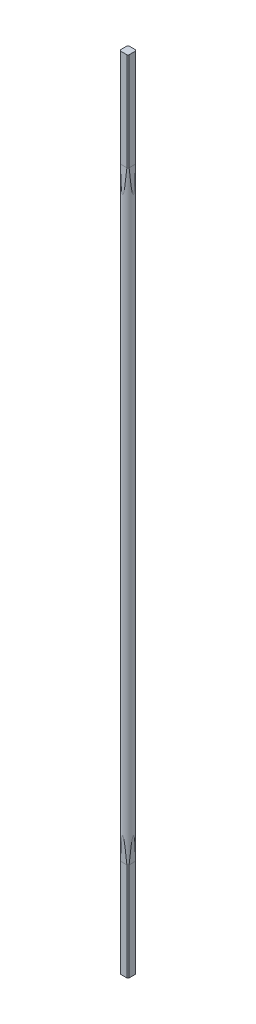
ISO-10303-21;
HEADER;
FILE_DESCRIPTION(('STEP AP214'),'2;1');
FILE_NAME('part.step','',(''),(''),'','','');
FILE_SCHEMA(('AUTOMOTIVE_DESIGN { 1 0 10303 214 1 1 1 1 }'));
ENDSEC;
DATA;
#1=APPLICATION_CONTEXT('core data for automotive mechanical design processes');
#2=APPLICATION_PROTOCOL_DEFINITION('international standard','automotive_design',2000,#1);
#3=PRODUCT_CONTEXT('',#1,'mechanical');
#4=PRODUCT('Part','Part','',(#3));
#5=PRODUCT_RELATED_PRODUCT_CATEGORY('part','',(#4));
#6=PRODUCT_DEFINITION_FORMATION('','',#4);
#7=PRODUCT_DEFINITION_CONTEXT('part definition',#1,'design');
#8=PRODUCT_DEFINITION('design','',#6,#7);
#9=PRODUCT_DEFINITION_SHAPE('','',#8);
#10=(LENGTH_UNIT() NAMED_UNIT(*) SI_UNIT(.MILLI.,.METRE.));
#11=(NAMED_UNIT(*) PLANE_ANGLE_UNIT() SI_UNIT($,.RADIAN.));
#12=(NAMED_UNIT(*) SI_UNIT($,.STERADIAN.) SOLID_ANGLE_UNIT());
#13=UNCERTAINTY_MEASURE_WITH_UNIT(LENGTH_MEASURE(1.E-05),#10,'distance_accuracy_value','');
#14=(GEOMETRIC_REPRESENTATION_CONTEXT(3) GLOBAL_UNCERTAINTY_ASSIGNED_CONTEXT((#13)) GLOBAL_UNIT_ASSIGNED_CONTEXT((#10,
#11,#12)) REPRESENTATION_CONTEXT('',''));
#15=CARTESIAN_POINT('',(0.,0.,0.));
#16=DIRECTION('',(0.,0.,1.));
#17=DIRECTION('',(1.,0.,0.));
#18=AXIS2_PLACEMENT_3D('',#15,#16,#17);
#19=CARTESIAN_POINT('',(0.,-245.,0.));
#20=DIRECTION('',(0.,1.,0.));
#21=DIRECTION('',(0.,0.,1.));
#22=AXIS2_PLACEMENT_3D('',#19,#20,#21);
#23=CYLINDRICAL_SURFACE('',#22,3.3);
#24=DIRECTION('',(0.,1.,0.));
#25=VECTOR('',#24,1.);
#26=CARTESIAN_POINT('',(1.96659604392971,-245.,2.65));
#27=LINE('',#26,#25);
#28=CARTESIAN_POINT('',(1.96659604392971,245.,2.65));
#29=VERTEX_POINT('',#28);
#30=CARTESIAN_POINT('',(1.96659604392971,185.,2.65));
#31=VERTEX_POINT('',#30);
#32=EDGE_CURVE('E305',#29,#31,#27,.F.);
#33=ORIENTED_EDGE('',*,*,#32,.T.);
#34=CARTESIAN_POINT('',(0.,245.694978703343,0.));
#35=DIRECTION('',(0.,-0.0436193873653361,-0.999048221581858));
#36=DIRECTION('',(0.,0.999048221581858,-0.0436193873653361));
#37=AXIS2_PLACEMENT_3D('',#34,#35,#36);
#38=ELLIPSE('',#37,75.6544325659759,3.3);
#39=CARTESIAN_POINT('',(-1.96659604392971,185.,2.65));
#40=VERTEX_POINT('',#39);
#41=EDGE_CURVE('E287',#31,#40,#38,.T.);
#42=ORIENTED_EDGE('',*,*,#41,.T.);
#43=DIRECTION('',(0.,1.,0.));
#44=VECTOR('',#43,1.);
#45=CARTESIAN_POINT('',(-1.96659604392971,-245.,2.65));
#46=LINE('',#45,#44);
#47=CARTESIAN_POINT('',(-1.96659604392971,245.,2.65));
#48=VERTEX_POINT('',#47);
#49=EDGE_CURVE('E302',#40,#48,#46,.T.);
#50=ORIENTED_EDGE('',*,*,#49,.T.);
#51=CARTESIAN_POINT('',(0.,245.,0.));
#52=DIRECTION('',(0.,1.,0.));
#53=DIRECTION('',(0.,0.,1.));
#54=AXIS2_PLACEMENT_3D('',#51,#52,#53);
#55=CIRCLE('',#54,3.3);
#56=CARTESIAN_POINT('',(-2.65,245.,1.96659604392971));
#57=VERTEX_POINT('',#56);
#58=EDGE_CURVE('E326',#57,#48,#55,.T.);
#59=ORIENTED_EDGE('',*,*,#58,.F.);
#60=DIRECTION('',(0.,1.,0.));
#61=VECTOR('',#60,1.);
#62=CARTESIAN_POINT('',(-2.65,-245.,1.96659604392971));
#63=LINE('',#62,#61);
#64=CARTESIAN_POINT('',(-2.65,185.,1.96659604392971));
#65=VERTEX_POINT('',#64);
#66=EDGE_CURVE('E323',#57,#65,#63,.F.);
#67=ORIENTED_EDGE('',*,*,#66,.T.);
#68=CARTESIAN_POINT('',(0.,245.694978703343,0.));
#69=DIRECTION('',(0.999048221581858,-0.0436193873653361,0.));
#70=DIRECTION('',(0.0436193873653361,0.999048221581858,0.));
#71=AXIS2_PLACEMENT_3D('',#68,#69,#70);
#72=ELLIPSE('',#71,75.6544325659759,3.3);
#73=CARTESIAN_POINT('',(-2.64999999999999,185.,-1.96659604392971));
#74=VERTEX_POINT('',#73);
#75=EDGE_CURVE('E273',#65,#74,#72,.T.);
#76=ORIENTED_EDGE('',*,*,#75,.T.);
#77=DIRECTION('',(0.,1.,0.));
#78=VECTOR('',#77,1.);
#79=CARTESIAN_POINT('',(-2.65,-245.,-1.96659604392971));
#80=LINE('',#79,#78);
#81=CARTESIAN_POINT('',(-2.65,245.,-1.96659604392971));
#82=VERTEX_POINT('',#81);
#83=EDGE_CURVE('E320',#74,#82,#80,.T.);
#84=ORIENTED_EDGE('',*,*,#83,.T.);
#85=CARTESIAN_POINT('',(-1.96659604392971,245.,-2.65));
#86=VERTEX_POINT('',#85);
#87=EDGE_CURVE('E422',#86,#82,#55,.T.);
#88=ORIENTED_EDGE('',*,*,#87,.F.);
#89=DIRECTION('',(0.,1.,0.));
#90=VECTOR('',#89,1.);
#91=CARTESIAN_POINT('',(-1.96659604392971,-245.,-2.65));
#92=LINE('',#91,#90);
#93=CARTESIAN_POINT('',(-1.96659604392971,185.,-2.65));
#94=VERTEX_POINT('',#93);
#95=EDGE_CURVE('E317',#86,#94,#92,.F.);
#96=ORIENTED_EDGE('',*,*,#95,.T.);
#97=CARTESIAN_POINT('',(0.,245.694978703343,0.));
#98=DIRECTION('',(0.,-0.0436193873653361,0.999048221581858));
#99=DIRECTION('',(0.,0.999048221581858,0.0436193873653361));
#100=AXIS2_PLACEMENT_3D('',#97,#98,#99);
#101=ELLIPSE('',#100,75.6544325659759,3.3);
#102=CARTESIAN_POINT('',(1.96659604392971,185.,-2.64999999999999));
#103=VERTEX_POINT('',#102);
#104=EDGE_CURVE('E276',#94,#103,#101,.T.);
#105=ORIENTED_EDGE('',*,*,#104,.T.);
#106=DIRECTION('',(0.,1.,0.));
#107=VECTOR('',#106,1.);
#108=CARTESIAN_POINT('',(1.96659604392971,-245.,-2.65));
#109=LINE('',#108,#107);
#110=CARTESIAN_POINT('',(1.96659604392971,245.,-2.65));
#111=VERTEX_POINT('',#110);
#112=EDGE_CURVE('E314',#103,#111,#109,.T.);
#113=ORIENTED_EDGE('',*,*,#112,.T.);
#114=CARTESIAN_POINT('',(2.65,245.,-1.96659604392971));
#115=VERTEX_POINT('',#114);
#116=EDGE_CURVE('E331',#115,#111,#55,.T.);
#117=ORIENTED_EDGE('',*,*,#116,.F.);
#118=DIRECTION('',(0.,1.,0.));
#119=VECTOR('',#118,1.);
#120=CARTESIAN_POINT('',(2.65,-245.,-1.96659604392971));
#121=LINE('',#120,#119);
#122=CARTESIAN_POINT('',(2.65,185.,-1.96659604392971));
#123=VERTEX_POINT('',#122);
#124=EDGE_CURVE('E311',#115,#123,#121,.F.);
#125=ORIENTED_EDGE('',*,*,#124,.T.);
#126=CARTESIAN_POINT('',(0.,245.694978703343,0.));
#127=DIRECTION('',(-0.999048221581858,-0.0436193873653361,0.));
#128=DIRECTION('',(-0.0436193873653361,0.999048221581858,0.));
#129=AXIS2_PLACEMENT_3D('',#126,#127,#128);
#130=ELLIPSE('',#129,75.6544325659759,3.3);
#131=CARTESIAN_POINT('',(2.65,185.,1.96659604392971));
#132=VERTEX_POINT('',#131);
#133=EDGE_CURVE('E284',#123,#132,#130,.T.);
#134=ORIENTED_EDGE('',*,*,#133,.T.);
#135=DIRECTION('',(0.,1.,0.));
#136=VECTOR('',#135,1.);
#137=CARTESIAN_POINT('',(2.65,-245.,1.96659604392971));
#138=LINE('',#137,#136);
#139=CARTESIAN_POINT('',(2.65,245.,1.96659604392971));
#140=VERTEX_POINT('',#139);
#141=EDGE_CURVE('E308',#132,#140,#138,.T.);
#142=ORIENTED_EDGE('',*,*,#141,.T.);
#143=EDGE_CURVE('E327',#29,#140,#55,.T.);
#144=ORIENTED_EDGE('',*,*,#143,.F.);
#145=EDGE_LOOP('',(#33,#42,#50,#59,#67,#76,#84,#88,#96,#105,#113,#117,#125,#134,#142,#144));
#146=FACE_BOUND('',#145,.T.);
#147=DIRECTION('',(0.,1.,0.));
#148=VECTOR('',#147,1.);
#149=CARTESIAN_POINT('',(1.96659604392971,-245.,-2.65));
#150=LINE('',#149,#148);
#151=CARTESIAN_POINT('',(1.96659604392971,-245.,-2.65));
#152=VERTEX_POINT('',#151);
#153=CARTESIAN_POINT('',(1.96659604392971,-185.,-2.65));
#154=VERTEX_POINT('',#153);
#155=EDGE_CURVE('E379',#152,#154,#150,.T.);
#156=ORIENTED_EDGE('',*,*,#155,.T.);
#157=CARTESIAN_POINT('',(0.,-245.694978703343,0.));
#158=DIRECTION('',(0.,0.0436193873653361,0.999048221581858));
#159=DIRECTION('',(0.,0.999048221581858,-0.0436193873653361));
#160=AXIS2_PLACEMENT_3D('',#157,#158,#159);
#161=ELLIPSE('',#160,75.6544325659759,3.3);
#162=CARTESIAN_POINT('',(-1.96659604392971,-185.,-2.65));
#163=VERTEX_POINT('',#162);
#164=EDGE_CURVE('E261',#154,#163,#161,.T.);
#165=ORIENTED_EDGE('',*,*,#164,.T.);
#166=DIRECTION('',(0.,1.,0.));
#167=VECTOR('',#166,1.);
#168=CARTESIAN_POINT('',(-1.96659604392971,-245.,-2.65));
#169=LINE('',#168,#167);
#170=CARTESIAN_POINT('',(-1.96659604392971,-245.,-2.65));
#171=VERTEX_POINT('',#170);
#172=EDGE_CURVE('E374',#163,#171,#169,.F.);
#173=ORIENTED_EDGE('',*,*,#172,.T.);
#174=CARTESIAN_POINT('',(0.,-245.,0.));
#175=DIRECTION('',(0.,1.,0.));
#176=DIRECTION('',(0.,0.,1.));
#177=AXIS2_PLACEMENT_3D('',#174,#175,#176);
#178=CIRCLE('',#177,3.3);
#179=CARTESIAN_POINT('',(-2.65,-245.,-1.96659604392971));
#180=VERTEX_POINT('',#179);
#181=EDGE_CURVE('E395',#171,#180,#178,.T.);
#182=ORIENTED_EDGE('',*,*,#181,.T.);
#183=DIRECTION('',(0.,1.,0.));
#184=VECTOR('',#183,1.);
#185=CARTESIAN_POINT('',(-2.65,-245.,-1.96659604392971));
#186=LINE('',#185,#184);
#187=CARTESIAN_POINT('',(-2.65,-185.,-1.96659604392971));
#188=VERTEX_POINT('',#187);
#189=EDGE_CURVE('E165',#180,#188,#186,.T.);
#190=ORIENTED_EDGE('',*,*,#189,.T.);
#191=CARTESIAN_POINT('',(0.,-245.694978703343,0.));
#192=DIRECTION('',(0.999048221581858,0.0436193873653361,0.));
#193=DIRECTION('',(-0.0436193873653361,0.999048221581858,0.));
#194=AXIS2_PLACEMENT_3D('',#191,#192,#193);
#195=ELLIPSE('',#194,75.6544325659759,3.3);
#196=CARTESIAN_POINT('',(-2.65,-185.,1.96659604392971));
#197=VERTEX_POINT('',#196);
#198=EDGE_CURVE('E258',#188,#197,#195,.T.);
#199=ORIENTED_EDGE('',*,*,#198,.T.);
#200=DIRECTION('',(0.,1.,0.));
#201=VECTOR('',#200,1.);
#202=CARTESIAN_POINT('',(-2.65,-245.,1.96659604392971));
#203=LINE('',#202,#201);
#204=CARTESIAN_POINT('',(-2.65,-245.,1.96659604392971));
#205=VERTEX_POINT('',#204);
#206=EDGE_CURVE('E267',#197,#205,#203,.F.);
#207=ORIENTED_EDGE('',*,*,#206,.T.);
#208=CARTESIAN_POINT('',(-1.96659604392971,-245.,2.65));
#209=VERTEX_POINT('',#208);
#210=EDGE_CURVE('E330',#205,#209,#178,.T.);
#211=ORIENTED_EDGE('',*,*,#210,.T.);
#212=DIRECTION('',(0.,1.,0.));
#213=VECTOR('',#212,1.);
#214=CARTESIAN_POINT('',(-1.96659604392971,-245.,2.65));
#215=LINE('',#214,#213);
#216=CARTESIAN_POINT('',(-1.96659604392971,-185.,2.65));
#217=VERTEX_POINT('',#216);
#218=EDGE_CURVE('E158',#209,#217,#215,.T.);
#219=ORIENTED_EDGE('',*,*,#218,.T.);
#220=CARTESIAN_POINT('',(0.,-245.694978703343,0.));
#221=DIRECTION('',(0.,0.0436193873653361,-0.999048221581858));
#222=DIRECTION('',(0.,0.999048221581858,0.0436193873653361));
#223=AXIS2_PLACEMENT_3D('',#220,#221,#222);
#224=ELLIPSE('',#223,75.6544325659759,3.3);
#225=CARTESIAN_POINT('',(1.96659604392971,-185.,2.65));
#226=VERTEX_POINT('',#225);
#227=EDGE_CURVE('E270',#217,#226,#224,.T.);
#228=ORIENTED_EDGE('',*,*,#227,.T.);
#229=DIRECTION('',(0.,1.,0.));
#230=VECTOR('',#229,1.);
#231=CARTESIAN_POINT('',(1.96659604392971,-245.,2.65));
#232=LINE('',#231,#230);
#233=CARTESIAN_POINT('',(1.96659604392971,-245.,2.65));
#234=VERTEX_POINT('',#233);
#235=EDGE_CURVE('E278',#226,#234,#232,.F.);
#236=ORIENTED_EDGE('',*,*,#235,.T.);
#237=CARTESIAN_POINT('',(2.65,-245.,1.96659604392971));
#238=VERTEX_POINT('',#237);
#239=EDGE_CURVE('E332',#234,#238,#178,.T.);
#240=ORIENTED_EDGE('',*,*,#239,.T.);
#241=DIRECTION('',(0.,1.,0.));
#242=VECTOR('',#241,1.);
#243=CARTESIAN_POINT('',(2.65,-245.,1.96659604392971));
#244=LINE('',#243,#242);
#245=CARTESIAN_POINT('',(2.65,-185.,1.96659604392971));
#246=VERTEX_POINT('',#245);
#247=EDGE_CURVE('E369',#238,#246,#244,.T.);
#248=ORIENTED_EDGE('',*,*,#247,.T.);
#249=CARTESIAN_POINT('',(0.,-245.694978703343,0.));
#250=DIRECTION('',(-0.999048221581858,0.0436193873653361,0.));
#251=DIRECTION('',(0.0436193873653361,0.999048221581858,0.));
#252=AXIS2_PLACEMENT_3D('',#249,#250,#251);
#253=ELLIPSE('',#252,75.6544325659759,3.3);
#254=CARTESIAN_POINT('',(2.65,-185.,-1.96659604392971));
#255=VERTEX_POINT('',#254);
#256=EDGE_CURVE('E371',#246,#255,#253,.T.);
#257=ORIENTED_EDGE('',*,*,#256,.T.);
#258=DIRECTION('',(0.,1.,0.));
#259=VECTOR('',#258,1.);
#260=CARTESIAN_POINT('',(2.65,-245.,-1.96659604392971));
#261=LINE('',#260,#259);
#262=CARTESIAN_POINT('',(2.65,-245.,-1.96659604392971));
#263=VERTEX_POINT('',#262);
#264=EDGE_CURVE('E368',#255,#263,#261,.F.);
#265=ORIENTED_EDGE('',*,*,#264,.T.);
#266=EDGE_CURVE('E336',#263,#152,#178,.T.);
#267=ORIENTED_EDGE('',*,*,#266,.T.);
#268=EDGE_LOOP('',(#156,#165,#173,#182,#190,#199,#207,#211,#219,#228,#236,#240,#248,#257,#265,#267));
#269=FACE_BOUND('',#268,.T.);
#270=ADVANCED_FACE('F144',(#146,#269),#23,.T.);
#271=CARTESIAN_POINT('',(0.,-245.,0.));
#272=DIRECTION('',(0.,1.,0.));
#273=DIRECTION('',(0.,0.,1.));
#274=AXIS2_PLACEMENT_3D('',#271,#272,#273);
#275=PLANE('',#274);
#276=DIRECTION('',(0.,0.,1.));
#277=VECTOR('',#276,1.);
#278=CARTESIAN_POINT('',(-2.65,-245.,0.));
#279=LINE('',#278,#277);
#280=EDGE_CURVE('E55',#180,#205,#279,.T.);
#281=ORIENTED_EDGE('',*,*,#280,.F.);
#282=ORIENTED_EDGE('',*,*,#181,.F.);
#283=DIRECTION('',(-1.,0.,0.));
#284=VECTOR('',#283,1.);
#285=CARTESIAN_POINT('',(0.,-245.,-2.65));
#286=LINE('',#285,#284);
#287=EDGE_CURVE('E348',#152,#171,#286,.T.);
#288=ORIENTED_EDGE('',*,*,#287,.F.);
#289=ORIENTED_EDGE('',*,*,#266,.F.);
#290=DIRECTION('',(0.,0.,-1.));
#291=VECTOR('',#290,1.);
#292=CARTESIAN_POINT('',(2.65,-245.,0.));
#293=LINE('',#292,#291);
#294=EDGE_CURVE('E350',#238,#263,#293,.T.);
#295=ORIENTED_EDGE('',*,*,#294,.F.);
#296=ORIENTED_EDGE('',*,*,#239,.F.);
#297=DIRECTION('',(1.,0.,0.));
#298=VECTOR('',#297,1.);
#299=CARTESIAN_POINT('',(0.,-245.,2.65));
#300=LINE('',#299,#298);
#301=EDGE_CURVE('E151',#209,#234,#300,.T.);
#302=ORIENTED_EDGE('',*,*,#301,.F.);
#303=ORIENTED_EDGE('',*,*,#210,.F.);
#304=EDGE_LOOP('',(#281,#282,#288,#289,#295,#296,#302,#303));
#305=FACE_BOUND('',#304,.T.);
#306=ADVANCED_FACE('F359',(#305),#275,.F.);
#307=CARTESIAN_POINT('',(0.,245.,0.));
#308=DIRECTION('',(0.,1.,0.));
#309=DIRECTION('',(0.,0.,1.));
#310=AXIS2_PLACEMENT_3D('',#307,#308,#309);
#311=PLANE('',#310);
#312=ORIENTED_EDGE('',*,*,#87,.T.);
#313=DIRECTION('',(0.,0.,1.));
#314=VECTOR('',#313,1.);
#315=CARTESIAN_POINT('',(-2.65,245.,0.));
#316=LINE('',#315,#314);
#317=EDGE_CURVE('E345',#82,#57,#316,.T.);
#318=ORIENTED_EDGE('',*,*,#317,.T.);
#319=ORIENTED_EDGE('',*,*,#58,.T.);
#320=DIRECTION('',(1.,0.,0.));
#321=VECTOR('',#320,1.);
#322=CARTESIAN_POINT('',(0.,245.,2.65));
#323=LINE('',#322,#321);
#324=EDGE_CURVE('E335',#48,#29,#323,.T.);
#325=ORIENTED_EDGE('',*,*,#324,.T.);
#326=ORIENTED_EDGE('',*,*,#143,.T.);
#327=DIRECTION('',(0.,0.,-1.));
#328=VECTOR('',#327,1.);
#329=CARTESIAN_POINT('',(2.65,245.,0.));
#330=LINE('',#329,#328);
#331=EDGE_CURVE('E339',#140,#115,#330,.T.);
#332=ORIENTED_EDGE('',*,*,#331,.T.);
#333=ORIENTED_EDGE('',*,*,#116,.T.);
#334=DIRECTION('',(-1.,0.,0.));
#335=VECTOR('',#334,1.);
#336=CARTESIAN_POINT('',(0.,245.,-2.65));
#337=LINE('',#336,#335);
#338=EDGE_CURVE('E342',#111,#86,#337,.T.);
#339=ORIENTED_EDGE('',*,*,#338,.T.);
#340=EDGE_LOOP('',(#312,#318,#319,#325,#326,#332,#333,#339));
#341=FACE_BOUND('',#340,.T.);
#342=ADVANCED_FACE('F413',(#341),#311,.T.);
#343=CARTESIAN_POINT('',(-2.65,185.,2.65));
#344=DIRECTION('',(0.,0.,1.));
#345=DIRECTION('',(1.,0.,0.));
#346=AXIS2_PLACEMENT_3D('',#343,#344,#345);
#347=PLANE('',#346);
#348=ORIENTED_EDGE('',*,*,#324,.F.);
#349=ORIENTED_EDGE('',*,*,#49,.F.);
#350=DIRECTION('',(1.,0.,0.));
#351=VECTOR('',#350,1.);
#352=CARTESIAN_POINT('',(-2.65,185.,2.65));
#353=LINE('',#352,#351);
#354=EDGE_CURVE('E293',#40,#31,#353,.T.);
#355=ORIENTED_EDGE('',*,*,#354,.T.);
#356=ORIENTED_EDGE('',*,*,#32,.F.);
#357=EDGE_LOOP('',(#348,#349,#355,#356));
#358=FACE_BOUND('',#357,.T.);
#359=ADVANCED_FACE('F417',(#358),#347,.T.);
#360=CARTESIAN_POINT('',(2.65,185.,-2.65));
#361=DIRECTION('',(1.,0.,0.));
#362=DIRECTION('',(0.,0.,-1.));
#363=AXIS2_PLACEMENT_3D('',#360,#361,#362);
#364=PLANE('',#363);
#365=ORIENTED_EDGE('',*,*,#331,.F.);
#366=ORIENTED_EDGE('',*,*,#141,.F.);
#367=DIRECTION('',(0.,0.,-1.));
#368=VECTOR('',#367,1.);
#369=CARTESIAN_POINT('',(2.65,185.,-2.65));
#370=LINE('',#369,#368);
#371=EDGE_CURVE('E296',#132,#123,#370,.T.);
#372=ORIENTED_EDGE('',*,*,#371,.T.);
#373=ORIENTED_EDGE('',*,*,#124,.F.);
#374=EDGE_LOOP('',(#365,#366,#372,#373));
#375=FACE_BOUND('',#374,.T.);
#376=ADVANCED_FACE('F454',(#375),#364,.T.);
#377=CARTESIAN_POINT('',(-2.65,185.,-2.65));
#378=DIRECTION('',(0.,0.,-1.));
#379=DIRECTION('',(-1.,0.,0.));
#380=AXIS2_PLACEMENT_3D('',#377,#378,#379);
#381=PLANE('',#380);
#382=ORIENTED_EDGE('',*,*,#338,.F.);
#383=ORIENTED_EDGE('',*,*,#112,.F.);
#384=DIRECTION('',(-1.,0.,0.));
#385=VECTOR('',#384,1.);
#386=CARTESIAN_POINT('',(-2.65,185.,-2.65));
#387=LINE('',#386,#385);
#388=EDGE_CURVE('E299',#103,#94,#387,.T.);
#389=ORIENTED_EDGE('',*,*,#388,.T.);
#390=ORIENTED_EDGE('',*,*,#95,.F.);
#391=EDGE_LOOP('',(#382,#383,#389,#390));
#392=FACE_BOUND('',#391,.T.);
#393=ADVANCED_FACE('F428',(#392),#381,.T.);
#394=CARTESIAN_POINT('',(-2.65,185.,-2.65));
#395=DIRECTION('',(-1.,0.,0.));
#396=DIRECTION('',(0.,0.,1.));
#397=AXIS2_PLACEMENT_3D('',#394,#395,#396);
#398=PLANE('',#397);
#399=ORIENTED_EDGE('',*,*,#317,.F.);
#400=ORIENTED_EDGE('',*,*,#83,.F.);
#401=DIRECTION('',(0.,0.,1.));
#402=VECTOR('',#401,1.);
#403=CARTESIAN_POINT('',(-2.65,185.,-2.65));
#404=LINE('',#403,#402);
#405=EDGE_CURVE('E290',#74,#65,#404,.T.);
#406=ORIENTED_EDGE('',*,*,#405,.T.);
#407=ORIENTED_EDGE('',*,*,#66,.F.);
#408=EDGE_LOOP('',(#399,#400,#406,#407));
#409=FACE_BOUND('',#408,.T.);
#410=ADVANCED_FACE('F431',(#409),#398,.T.);
#411=CARTESIAN_POINT('',(-2.65,185.,2.65));
#412=DIRECTION('',(0.999048221581858,-0.0436193873653361,0.));
#413=DIRECTION('',(0.0436193873653361,0.999048221581858,0.));
#414=AXIS2_PLACEMENT_3D('',#411,#412,#413);
#415=PLANE('',#414);
#416=ORIENTED_EDGE('',*,*,#405,.F.);
#417=ORIENTED_EDGE('',*,*,#75,.F.);
#418=EDGE_LOOP('',(#416,#417));
#419=FACE_BOUND('',#418,.T.);
#420=ADVANCED_FACE('F433',(#419),#415,.F.);
#421=CARTESIAN_POINT('',(-2.65,185.,-2.65));
#422=DIRECTION('',(0.,-0.0436193873653361,0.999048221581858));
#423=DIRECTION('',(0.,-0.999048221581858,-0.0436193873653361));
#424=AXIS2_PLACEMENT_3D('',#421,#422,#423);
#425=PLANE('',#424);
#426=ORIENTED_EDGE('',*,*,#388,.F.);
#427=ORIENTED_EDGE('',*,*,#104,.F.);
#428=EDGE_LOOP('',(#426,#427));
#429=FACE_BOUND('',#428,.T.);
#430=ADVANCED_FACE('F435',(#429),#425,.F.);
#431=CARTESIAN_POINT('',(2.65,185.,-2.65));
#432=DIRECTION('',(-0.999048221581858,-0.0436193873653361,0.));
#433=DIRECTION('',(0.0436193873653361,-0.999048221581858,0.));
#434=AXIS2_PLACEMENT_3D('',#431,#432,#433);
#435=PLANE('',#434);
#436=ORIENTED_EDGE('',*,*,#371,.F.);
#437=ORIENTED_EDGE('',*,*,#133,.F.);
#438=EDGE_LOOP('',(#436,#437));
#439=FACE_BOUND('',#438,.T.);
#440=ADVANCED_FACE('F441',(#439),#435,.F.);
#441=CARTESIAN_POINT('',(-1.96659604392971,185.,2.65));
#442=DIRECTION('',(0.,-0.0436193873653361,-0.999048221581858));
#443=DIRECTION('',(0.,0.999048221581858,-0.0436193873653361));
#444=AXIS2_PLACEMENT_3D('',#441,#442,#443);
#445=PLANE('',#444);
#446=ORIENTED_EDGE('',*,*,#354,.F.);
#447=ORIENTED_EDGE('',*,*,#41,.F.);
#448=EDGE_LOOP('',(#446,#447));
#449=FACE_BOUND('',#448,.T.);
#450=ADVANCED_FACE('F446',(#449),#445,.F.);
#451=CARTESIAN_POINT('',(-2.65,-185.,-2.65));
#452=DIRECTION('',(0.,0.,-1.));
#453=DIRECTION('',(-1.,0.,0.));
#454=AXIS2_PLACEMENT_3D('',#451,#452,#453);
#455=PLANE('',#454);
#456=DIRECTION('',(1.,0.,0.));
#457=VECTOR('',#456,1.);
#458=CARTESIAN_POINT('',(-2.65,-185.,-2.65));
#459=LINE('',#458,#457);
#460=EDGE_CURVE('E260',#163,#154,#459,.T.);
#461=ORIENTED_EDGE('',*,*,#460,.T.);
#462=ORIENTED_EDGE('',*,*,#155,.F.);
#463=ORIENTED_EDGE('',*,*,#287,.T.);
#464=ORIENTED_EDGE('',*,*,#172,.F.);
#465=EDGE_LOOP('',(#461,#462,#463,#464));
#466=FACE_BOUND('',#465,.T.);
#467=ADVANCED_FACE('F394',(#466),#455,.T.);
#468=CARTESIAN_POINT('',(2.65,-185.,2.65));
#469=DIRECTION('',(1.,0.,0.));
#470=DIRECTION('',(0.,0.,-1.));
#471=AXIS2_PLACEMENT_3D('',#468,#469,#470);
#472=PLANE('',#471);
#473=DIRECTION('',(0.,0.,1.));
#474=VECTOR('',#473,1.);
#475=CARTESIAN_POINT('',(2.65,-185.,2.65));
#476=LINE('',#475,#474);
#477=EDGE_CURVE('E383',#255,#246,#476,.T.);
#478=ORIENTED_EDGE('',*,*,#477,.T.);
#479=ORIENTED_EDGE('',*,*,#247,.F.);
#480=ORIENTED_EDGE('',*,*,#294,.T.);
#481=ORIENTED_EDGE('',*,*,#264,.F.);
#482=EDGE_LOOP('',(#478,#479,#480,#481));
#483=FACE_BOUND('',#482,.T.);
#484=ADVANCED_FACE('F367',(#483),#472,.T.);
#485=CARTESIAN_POINT('',(-2.65,-185.,2.65));
#486=DIRECTION('',(0.,0.,1.));
#487=DIRECTION('',(1.,0.,0.));
#488=AXIS2_PLACEMENT_3D('',#485,#486,#487);
#489=PLANE('',#488);
#490=DIRECTION('',(-1.,0.,0.));
#491=VECTOR('',#490,1.);
#492=CARTESIAN_POINT('',(-2.65,-185.,2.65));
#493=LINE('',#492,#491);
#494=EDGE_CURVE('E381',#226,#217,#493,.T.);
#495=ORIENTED_EDGE('',*,*,#494,.T.);
#496=ORIENTED_EDGE('',*,*,#218,.F.);
#497=ORIENTED_EDGE('',*,*,#301,.T.);
#498=ORIENTED_EDGE('',*,*,#235,.F.);
#499=EDGE_LOOP('',(#495,#496,#497,#498));
#500=FACE_BOUND('',#499,.T.);
#501=ADVANCED_FACE('F353',(#500),#489,.T.);
#502=CARTESIAN_POINT('',(-2.65,-185.,2.65));
#503=DIRECTION('',(-1.,0.,0.));
#504=DIRECTION('',(0.,0.,1.));
#505=AXIS2_PLACEMENT_3D('',#502,#503,#504);
#506=PLANE('',#505);
#507=DIRECTION('',(0.,0.,-1.));
#508=VECTOR('',#507,1.);
#509=CARTESIAN_POINT('',(-2.65,-185.,2.65));
#510=LINE('',#509,#508);
#511=EDGE_CURVE('E255',#197,#188,#510,.T.);
#512=ORIENTED_EDGE('',*,*,#511,.T.);
#513=ORIENTED_EDGE('',*,*,#189,.F.);
#514=ORIENTED_EDGE('',*,*,#280,.T.);
#515=ORIENTED_EDGE('',*,*,#206,.F.);
#516=EDGE_LOOP('',(#512,#513,#514,#515));
#517=FACE_BOUND('',#516,.T.);
#518=ADVANCED_FACE('F272',(#517),#506,.T.);
#519=CARTESIAN_POINT('',(-2.65,-185.,-1.96659604392971));
#520=DIRECTION('',(0.999048221581858,0.0436193873653361,0.));
#521=DIRECTION('',(-0.0436193873653361,0.999048221581858,0.));
#522=AXIS2_PLACEMENT_3D('',#519,#520,#521);
#523=PLANE('',#522);
#524=ORIENTED_EDGE('',*,*,#511,.F.);
#525=ORIENTED_EDGE('',*,*,#198,.F.);
#526=EDGE_LOOP('',(#524,#525));
#527=FACE_BOUND('',#526,.T.);
#528=ADVANCED_FACE('F257',(#527),#523,.F.);
#529=CARTESIAN_POINT('',(-1.96659604392971,-185.,2.65));
#530=DIRECTION('',(0.,0.0436193873653361,-0.999048221581858));
#531=DIRECTION('',(0.,0.999048221581858,0.0436193873653361));
#532=AXIS2_PLACEMENT_3D('',#529,#530,#531);
#533=PLANE('',#532);
#534=ORIENTED_EDGE('',*,*,#494,.F.);
#535=ORIENTED_EDGE('',*,*,#227,.F.);
#536=EDGE_LOOP('',(#534,#535));
#537=FACE_BOUND('',#536,.T.);
#538=ADVANCED_FACE('F403',(#537),#533,.F.);
#539=CARTESIAN_POINT('',(2.65,-185.,1.96659604392971));
#540=DIRECTION('',(-0.999048221581858,0.0436193873653361,0.));
#541=DIRECTION('',(-0.0436193873653361,-0.999048221581858,0.));
#542=AXIS2_PLACEMENT_3D('',#539,#540,#541);
#543=PLANE('',#542);
#544=ORIENTED_EDGE('',*,*,#477,.F.);
#545=ORIENTED_EDGE('',*,*,#256,.F.);
#546=EDGE_LOOP('',(#544,#545));
#547=FACE_BOUND('',#546,.T.);
#548=ADVANCED_FACE('F398',(#547),#543,.F.);
#549=CARTESIAN_POINT('',(1.96659604392971,-185.,-2.65));
#550=DIRECTION('',(0.,0.0436193873653361,0.999048221581858));
#551=DIRECTION('',(0.,-0.999048221581858,0.0436193873653361));
#552=AXIS2_PLACEMENT_3D('',#549,#550,#551);
#553=PLANE('',#552);
#554=ORIENTED_EDGE('',*,*,#460,.F.);
#555=ORIENTED_EDGE('',*,*,#164,.F.);
#556=EDGE_LOOP('',(#554,#555));
#557=FACE_BOUND('',#556,.T.);
#558=ADVANCED_FACE('F396',(#557),#553,.F.);
#559=CLOSED_SHELL('',(#270,#306,#342,#359,#376,#393,#410,#420,#430,#440,#450,#467,#484,#501,
#518,#528,#538,#548,#558));
#560=MANIFOLD_SOLID_BREP('B7',#559);
#561=ADVANCED_BREP_SHAPE_REPRESENTATION('',(#18,#560),#14);
#562=SHAPE_DEFINITION_REPRESENTATION(#9,#561);
ENDSEC;
END-ISO-10303-21;
